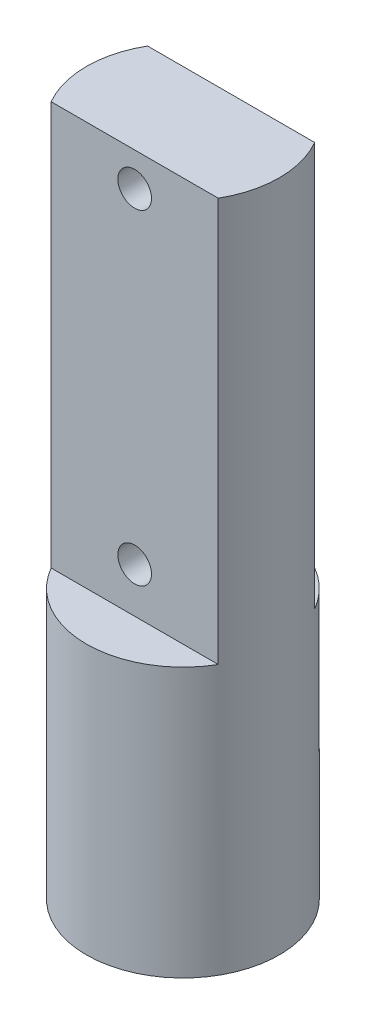
ISO-10303-21;
HEADER;
FILE_DESCRIPTION(('STEP AP214'),'2;1');
FILE_NAME('part.step','',(''),(''),'','','');
FILE_SCHEMA(('AUTOMOTIVE_DESIGN { 1 0 10303 214 1 1 1 1 }'));
ENDSEC;
DATA;
#1=APPLICATION_CONTEXT('core data for automotive mechanical design processes');
#2=APPLICATION_PROTOCOL_DEFINITION('international standard','automotive_design',2000,#1);
#3=PRODUCT_CONTEXT('',#1,'mechanical');
#4=PRODUCT('Part','Part','',(#3));
#5=PRODUCT_RELATED_PRODUCT_CATEGORY('part','',(#4));
#6=PRODUCT_DEFINITION_FORMATION('','',#4);
#7=PRODUCT_DEFINITION_CONTEXT('part definition',#1,'design');
#8=PRODUCT_DEFINITION('design','',#6,#7);
#9=PRODUCT_DEFINITION_SHAPE('','',#8);
#10=(LENGTH_UNIT() NAMED_UNIT(*) SI_UNIT(.MILLI.,.METRE.));
#11=(NAMED_UNIT(*) PLANE_ANGLE_UNIT() SI_UNIT($,.RADIAN.));
#12=(NAMED_UNIT(*) SI_UNIT($,.STERADIAN.) SOLID_ANGLE_UNIT());
#13=UNCERTAINTY_MEASURE_WITH_UNIT(LENGTH_MEASURE(1.E-05),#10,'distance_accuracy_value','');
#14=(GEOMETRIC_REPRESENTATION_CONTEXT(3) GLOBAL_UNCERTAINTY_ASSIGNED_CONTEXT((#13)) GLOBAL_UNIT_ASSIGNED_CONTEXT((#10,
#11,#12)) REPRESENTATION_CONTEXT('',''));
#15=CARTESIAN_POINT('',(0.,0.,0.));
#16=DIRECTION('',(0.,0.,1.));
#17=DIRECTION('',(1.,0.,0.));
#18=AXIS2_PLACEMENT_3D('',#15,#16,#17);
#19=CARTESIAN_POINT('',(0.,30.,0.));
#20=DIRECTION('',(0.,-1.,0.));
#21=DIRECTION('',(0.,0.,-1.));
#22=AXIS2_PLACEMENT_3D('',#19,#20,#21);
#23=CYLINDRICAL_SURFACE('',#22,4.3);
#24=CARTESIAN_POINT('',(-4.3,0.25,0.));
#25=CARTESIAN_POINT('',(-4.29999926638972,0.250001648928864,-0.0417880508407482));
#26=CARTESIAN_POINT('',(-4.2993845208085,0.253504282248725,-0.0835981818989071));
#27=CARTESIAN_POINT('',(-4.29699139488289,0.267415300580521,-0.166043809446362));
#28=CARTESIAN_POINT('',(-4.2952119760692,0.277829848648529,-0.206678223824261));
#29=CARTESIAN_POINT('',(-4.29068889751024,0.305239026463114,-0.285567841982349));
#30=CARTESIAN_POINT('',(-4.28794605633779,0.322228071424315,-0.323825033197758));
#31=CARTESIAN_POINT('',(-4.2817969720203,0.362288909924635,-0.396941522328641));
#32=CARTESIAN_POINT('',(-4.27839079673796,0.385360081314374,-0.431801167284692));
#33=CARTESIAN_POINT('',(-4.27125233222738,0.437186031595139,-0.497500986438229));
#34=CARTESIAN_POINT('',(-4.2675172948537,0.465991870364442,-0.528300588792169));
#35=CARTESIAN_POINT('',(-4.26016287101436,0.528359577761016,-0.584655380746544));
#36=CARTESIAN_POINT('',(-4.25654349221094,0.561921760693548,-0.610210223493173));
#37=CARTESIAN_POINT('',(-4.24980354586789,0.633131060922035,-0.655514911708166));
#38=CARTESIAN_POINT('',(-4.24668652699381,0.670804333579496,-0.67522422067108));
#39=CARTESIAN_POINT('',(-4.24134257686722,0.748990473640167,-0.708019045830521));
#40=CARTESIAN_POINT('',(-4.23911557958536,0.789503130131604,-0.721105053418914));
#41=CARTESIAN_POINT('',(-4.23583129642163,0.871786457694657,-0.740153116513572));
#42=CARTESIAN_POINT('',(-4.2347624743742,0.913540383710471,-0.746185479552076));
#43=CARTESIAN_POINT('',(-4.23388070551353,0.997480387393108,-0.751173093691664));
#44=CARTESIAN_POINT('',(-4.23406766135466,1.03966643130981,-0.750128893355033));
#45=CARTESIAN_POINT('',(-4.23566580216719,1.12276860803946,-0.74105019665266));
#46=CARTESIAN_POINT('',(-4.23706309423948,1.16369371315601,-0.733095025155751));
#47=CARTESIAN_POINT('',(-4.24090269461358,1.24361932870381,-0.710544848893874));
#48=CARTESIAN_POINT('',(-4.24334504185311,1.28261976736349,-0.695949596724768));
#49=CARTESIAN_POINT('',(-4.2490143958248,1.35782451258538,-0.660454167933393));
#50=CARTESIAN_POINT('',(-4.25224544405839,1.39401310944759,-0.639521379003615));
#51=CARTESIAN_POINT('',(-4.25912538619726,1.46239415898011,-0.591968203023326));
#52=CARTESIAN_POINT('',(-4.26277431694257,1.49458625880174,-0.565347314337231));
#53=CARTESIAN_POINT('',(-4.27013974606156,1.55451936881401,-0.506743025804354));
#54=CARTESIAN_POINT('',(-4.27385648859078,1.58219391382337,-0.474691640408195));
#55=CARTESIAN_POINT('',(-4.28089299866022,1.63178252295475,-0.4063652311659));
#56=CARTESIAN_POINT('',(-4.28421276317013,1.65369654310555,-0.370090175082709));
#57=CARTESIAN_POINT('',(-4.29008666470831,1.69114942661306,-0.294281196215158));
#58=CARTESIAN_POINT('',(-4.29264005113561,1.70668204539395,-0.254744126562682));
#59=CARTESIAN_POINT('',(-4.29668756322354,1.73086755941298,-0.173567831932192));
#60=CARTESIAN_POINT('',(-4.29818178604495,1.73952108570317,-0.131928800149992));
#61=CARTESIAN_POINT('',(-4.29992944696258,1.7496118073207,-0.0483030504041));
#62=CARTESIAN_POINT('',(-4.3001985614524,1.75114018168856,-0.00632765104635834));
#63=CARTESIAN_POINT('',(-4.29950875179802,1.74718083650912,0.0772792291684754));
#64=CARTESIAN_POINT('',(-4.29854987957069,1.74169341357592,0.11891072449026));
#65=CARTESIAN_POINT('',(-4.29552156034356,1.72393407350918,0.200363676970759));
#66=CARTESIAN_POINT('',(-4.29345956389819,1.71170765528832,0.240195355348366));
#67=CARTESIAN_POINT('',(-4.28845524658441,1.68086615385983,0.31724359746027));
#68=CARTESIAN_POINT('',(-4.28551287244903,1.66225068407471,0.354460002790035));
#69=CARTESIAN_POINT('',(-4.27903518267186,1.61895320290467,0.425614839024295));
#70=CARTESIAN_POINT('',(-4.27549444710934,1.59421468054526,0.459518380058128));
#71=CARTESIAN_POINT('',(-4.26822821844665,1.53945060738056,0.522725487316165));
#72=CARTESIAN_POINT('',(-4.26450271058035,1.50942463353665,0.552028685120829));
#73=CARTESIAN_POINT('',(-4.25723565824332,1.44452762498483,0.60554434083323));
#74=CARTESIAN_POINT('',(-4.25369669469759,1.40960526532975,0.62969496515801));
#75=CARTESIAN_POINT('',(-4.24725293297475,1.33614574580622,0.671787047550439));
#76=CARTESIAN_POINT('',(-4.24434811335954,1.29760870819983,0.689728715532231));
#77=CARTESIAN_POINT('',(-4.23952122215334,1.21818092720123,0.71880282079533));
#78=CARTESIAN_POINT('',(-4.23759484131931,1.17730140271792,0.729965158951758));
#79=CARTESIAN_POINT('',(-4.23493246488616,1.0942109356068,0.745257214187159));
#80=CARTESIAN_POINT('',(-4.23419635490076,1.05200012131488,0.749387607045549));
#81=CARTESIAN_POINT('',(-4.23400311265296,0.968063389187448,0.750478315138877));
#82=CARTESIAN_POINT('',(-4.23452860691097,0.926338745295987,0.747536027155071));
#83=CARTESIAN_POINT('',(-4.23676112646517,0.843988132513841,0.734776442246822));
#84=CARTESIAN_POINT('',(-4.23846814684283,0.803362159050271,0.724959173942));
#85=CARTESIAN_POINT('',(-4.24286451900407,0.724405073036289,0.698766999037293));
#86=CARTESIAN_POINT('',(-4.2455524973939,0.686070838833909,0.682401257576454));
#87=CARTESIAN_POINT('',(-4.2516091088947,0.612676452519474,0.643586916823754));
#88=CARTESIAN_POINT('',(-4.25497778098402,0.577616488069058,0.621137969166094));
#89=CARTESIAN_POINT('',(-4.26207088679326,0.511275265173909,0.570450068884655));
#90=CARTESIAN_POINT('',(-4.26579937145496,0.48004897367634,0.542139730404381));
#91=CARTESIAN_POINT('',(-4.27316041880179,0.42275719633857,0.480682687943183));
#92=CARTESIAN_POINT('',(-4.27679295920461,0.396692900355416,0.447534871958872));
#93=CARTESIAN_POINT('',(-4.28358514702488,0.350281411357932,0.377041827580638));
#94=CARTESIAN_POINT('',(-4.28674096989397,0.329979413928963,0.339666468462769));
#95=CARTESIAN_POINT('',(-4.29218692806471,0.295974054354022,0.261994677005647));
#96=CARTESIAN_POINT('',(-4.29447790760072,0.282264253503343,0.221701139351332));
#97=CARTESIAN_POINT('',(-4.29744780863532,0.264739781276116,0.151053464857476));
#98=CARTESIAN_POINT('',(-4.29839966207502,0.259221425489235,0.121121834423538));
#99=CARTESIAN_POINT('',(-4.29967601838447,0.25185097154175,0.0607973595026825));
#100=CARTESIAN_POINT('',(-4.30000053376673,0.249998800257571,0.0304045242268715));
#101=CARTESIAN_POINT('',(-4.3,0.25,0.));
#102=B_SPLINE_CURVE_WITH_KNOTS('',3,(#24,#25,#26,#27,#28,#29,#30,#31,#32,#33,#34,#35,#36,#37,
#38,#39,#40,#41,#42,#43,#44,#45,#46,#47,#48,#49,#50,#51,#52,#53,#54,#55,#56,#57,#58,#59,#60,#61,
#62,#63,#64,#65,#66,#67,#68,#69,#70,#71,#72,#73,#74,#75,#76,#77,#78,#79,#80,#81,#82,#83,#84,#85,
#86,#87,#88,#89,#90,#91,#92,#93,#94,#95,#96,#97,#98,#99,#100,#101),.UNSPECIFIED.,.T.,.F.,(4,2,2,
2,2,2,2,2,2,2,2,2,2,2,2,2,2,2,2,2,2,2,2,2,2,2,2,2,2,2,2,2,2,2,2,2,2,2,4),(0.,0.125252996199785,
0.250617825406938,0.375876394889566,0.50112215646291,0.627537418061207,0.753961037239065,
0.881241888884177,1.00851329600257,1.13450500342474,1.26048694431127,1.38504167555774,
1.5096010479948,1.63481261051328,1.76003522004597,1.88696029547256,2.01388633971493,
2.14093629439122,2.26797459282222,2.39338266364192,2.51878543263069,2.64335172479294,
2.76792555532226,2.89369502791514,3.01947456765252,3.14668779548681,3.27389672204023,
3.40054042803455,3.52717196271096,3.65206968700409,3.77696689136787,3.90168989961903,
4.02642005186868,4.15276953204653,4.27914810238747,4.40649211316999,4.53371149107416,
4.62484600537639,4.71597870194454),.UNSPECIFIED.);
#103=CARTESIAN_POINT('',(-4.3,0.25,0.));
#104=VERTEX_POINT('',#103);
#105=EDGE_CURVE('E11',#104,#104,#102,.T.);
#106=ORIENTED_EDGE('',*,*,#105,.T.);
#107=EDGE_LOOP('',(#106));
#108=FACE_BOUND('',#107,.T.);
#109=CARTESIAN_POINT('',(0.,30.,0.));
#110=DIRECTION('',(0.,1.,0.));
#111=DIRECTION('',(0.,0.,1.));
#112=AXIS2_PLACEMENT_3D('',#109,#110,#111);
#113=CIRCLE('',#112,4.3);
#114=CARTESIAN_POINT('',(3.72390923627309,30.,2.15));
#115=VERTEX_POINT('',#114);
#116=CARTESIAN_POINT('',(3.72390923627308,30.,-2.15));
#117=VERTEX_POINT('',#116);
#118=EDGE_CURVE('E112',#115,#117,#113,.T.);
#119=ORIENTED_EDGE('',*,*,#118,.F.);
#120=DIRECTION('',(0.,1.,0.));
#121=VECTOR('',#120,1.);
#122=CARTESIAN_POINT('',(3.72390923627308,12.,2.15));
#123=LINE('',#122,#121);
#124=CARTESIAN_POINT('',(3.72390923627308,12.,2.15));
#125=VERTEX_POINT('',#124);
#126=EDGE_CURVE('E51',#125,#115,#123,.T.);
#127=ORIENTED_EDGE('',*,*,#126,.F.);
#128=CARTESIAN_POINT('',(0.,12.,0.));
#129=DIRECTION('',(0.,1.,0.));
#130=DIRECTION('',(0.,0.,1.));
#131=AXIS2_PLACEMENT_3D('',#128,#129,#130);
#132=CIRCLE('',#131,4.3);
#133=CARTESIAN_POINT('',(-3.72390923627308,12.,2.15));
#134=VERTEX_POINT('',#133);
#135=EDGE_CURVE('E81',#134,#125,#132,.T.);
#136=ORIENTED_EDGE('',*,*,#135,.F.);
#137=DIRECTION('',(0.,1.,0.));
#138=VECTOR('',#137,1.);
#139=CARTESIAN_POINT('',(-3.72390923627308,12.,2.15));
#140=LINE('',#139,#138);
#141=CARTESIAN_POINT('',(-3.72390923627308,30.,2.15));
#142=VERTEX_POINT('',#141);
#143=EDGE_CURVE('E85',#134,#142,#140,.T.);
#144=ORIENTED_EDGE('',*,*,#143,.T.);
#145=CARTESIAN_POINT('',(-3.72390923627309,30.,-2.15));
#146=VERTEX_POINT('',#145);
#147=EDGE_CURVE('E44',#146,#142,#113,.T.);
#148=ORIENTED_EDGE('',*,*,#147,.F.);
#149=DIRECTION('',(0.,1.,0.));
#150=VECTOR('',#149,1.);
#151=CARTESIAN_POINT('',(-3.72390923627308,12.,-2.15));
#152=LINE('',#151,#150);
#153=CARTESIAN_POINT('',(-3.72390923627308,12.,-2.15));
#154=VERTEX_POINT('',#153);
#155=EDGE_CURVE('E59',#154,#146,#152,.T.);
#156=ORIENTED_EDGE('',*,*,#155,.F.);
#157=CARTESIAN_POINT('',(0.,12.,0.));
#158=DIRECTION('',(0.,1.,0.));
#159=DIRECTION('',(0.,0.,-1.));
#160=AXIS2_PLACEMENT_3D('',#157,#158,#159);
#161=CIRCLE('',#160,4.3);
#162=CARTESIAN_POINT('',(3.72390923627308,12.,-2.15));
#163=VERTEX_POINT('',#162);
#164=EDGE_CURVE('E103',#163,#154,#161,.T.);
#165=ORIENTED_EDGE('',*,*,#164,.F.);
#166=DIRECTION('',(0.,1.,0.));
#167=VECTOR('',#166,1.);
#168=CARTESIAN_POINT('',(3.72390923627308,12.,-2.15));
#169=LINE('',#168,#167);
#170=EDGE_CURVE('E106',#163,#117,#169,.T.);
#171=ORIENTED_EDGE('',*,*,#170,.T.);
#172=EDGE_LOOP('',(#119,#127,#136,#144,#148,#156,#165,#171));
#173=FACE_BOUND('',#172,.T.);
#174=CARTESIAN_POINT('',(0.,0.,0.));
#175=DIRECTION('',(0.,1.,0.));
#176=DIRECTION('',(0.,0.,1.));
#177=AXIS2_PLACEMENT_3D('',#174,#175,#176);
#178=CIRCLE('',#177,4.3);
#179=CARTESIAN_POINT('',(0.,0.,4.3));
#180=VERTEX_POINT('',#179);
#181=EDGE_CURVE('E109',#180,#180,#178,.T.);
#182=ORIENTED_EDGE('',*,*,#181,.T.);
#183=EDGE_LOOP('',(#182));
#184=FACE_BOUND('',#183,.T.);
#185=ADVANCED_FACE('F33',(#108,#173,#184),#23,.T.);
#186=CARTESIAN_POINT('',(0.,30.,0.));
#187=DIRECTION('',(0.,1.,0.));
#188=DIRECTION('',(0.,0.,1.));
#189=AXIS2_PLACEMENT_3D('',#186,#187,#188);
#190=PLANE('',#189);
#191=DIRECTION('',(-1.,0.,0.));
#192=VECTOR('',#191,1.);
#193=CARTESIAN_POINT('',(0.,30.,2.15));
#194=LINE('',#193,#192);
#195=EDGE_CURVE('E82',#115,#142,#194,.T.);
#196=ORIENTED_EDGE('',*,*,#195,.F.);
#197=ORIENTED_EDGE('',*,*,#118,.T.);
#198=DIRECTION('',(1.,0.,0.));
#199=VECTOR('',#198,1.);
#200=CARTESIAN_POINT('',(0.,30.,-2.15));
#201=LINE('',#200,#199);
#202=EDGE_CURVE('E98',#146,#117,#201,.T.);
#203=ORIENTED_EDGE('',*,*,#202,.F.);
#204=ORIENTED_EDGE('',*,*,#147,.T.);
#205=EDGE_LOOP('',(#196,#197,#203,#204));
#206=FACE_BOUND('',#205,.T.);
#207=ADVANCED_FACE('F116',(#206),#190,.T.);
#208=CARTESIAN_POINT('',(0.,0.,0.));
#209=DIRECTION('',(0.,1.,0.));
#210=DIRECTION('',(0.,0.,1.));
#211=AXIS2_PLACEMENT_3D('',#208,#209,#210);
#212=PLANE('',#211);
#213=ORIENTED_EDGE('',*,*,#181,.F.);
#214=EDGE_LOOP('',(#213));
#215=FACE_BOUND('',#214,.T.);
#216=ADVANCED_FACE('F129',(#215),#212,.F.);
#217=CARTESIAN_POINT('',(0.,12.,-2.15));
#218=DIRECTION('',(0.,0.,1.));
#219=DIRECTION('',(1.,0.,0.));
#220=AXIS2_PLACEMENT_3D('',#217,#218,#219);
#221=PLANE('',#220);
#222=CARTESIAN_POINT('',(0.,28.5,-2.15));
#223=DIRECTION('',(0.,0.,1.));
#224=DIRECTION('',(1.,0.,0.));
#225=AXIS2_PLACEMENT_3D('',#222,#223,#224);
#226=CIRCLE('',#225,0.750000000000001);
#227=CARTESIAN_POINT('',(0.750000000000001,28.5,-2.15));
#228=VERTEX_POINT('',#227);
#229=EDGE_CURVE('E214',#228,#228,#226,.T.);
#230=ORIENTED_EDGE('',*,*,#229,.T.);
#231=EDGE_LOOP('',(#230));
#232=FACE_BOUND('',#231,.T.);
#233=CARTESIAN_POINT('',(0.,14.,-2.15));
#234=DIRECTION('',(0.,0.,1.));
#235=DIRECTION('',(1.,0.,0.));
#236=AXIS2_PLACEMENT_3D('',#233,#234,#235);
#237=CIRCLE('',#236,0.750000000000001);
#238=CARTESIAN_POINT('',(0.750000000000001,14.,-2.15));
#239=VERTEX_POINT('',#238);
#240=EDGE_CURVE('E97',#239,#239,#237,.T.);
#241=ORIENTED_EDGE('',*,*,#240,.T.);
#242=EDGE_LOOP('',(#241));
#243=FACE_BOUND('',#242,.T.);
#244=ORIENTED_EDGE('',*,*,#202,.T.);
#245=ORIENTED_EDGE('',*,*,#170,.F.);
#246=DIRECTION('',(1.,0.,0.));
#247=VECTOR('',#246,1.);
#248=CARTESIAN_POINT('',(0.,12.,-2.15));
#249=LINE('',#248,#247);
#250=EDGE_CURVE('E100',#154,#163,#249,.T.);
#251=ORIENTED_EDGE('',*,*,#250,.F.);
#252=ORIENTED_EDGE('',*,*,#155,.T.);
#253=EDGE_LOOP('',(#244,#245,#251,#252));
#254=FACE_BOUND('',#253,.T.);
#255=ADVANCED_FACE('F117',(#232,#243,#254),#221,.F.);
#256=CARTESIAN_POINT('',(0.,12.,0.));
#257=DIRECTION('',(0.,-1.,0.));
#258=DIRECTION('',(0.,0.,-1.));
#259=AXIS2_PLACEMENT_3D('',#256,#257,#258);
#260=PLANE('',#259);
#261=ORIENTED_EDGE('',*,*,#250,.T.);
#262=ORIENTED_EDGE('',*,*,#164,.T.);
#263=EDGE_LOOP('',(#261,#262));
#264=FACE_BOUND('',#263,.T.);
#265=ADVANCED_FACE('F120',(#264),#260,.F.);
#266=CARTESIAN_POINT('',(0.,12.,2.15));
#267=DIRECTION('',(0.,0.,-1.));
#268=DIRECTION('',(-1.,0.,0.));
#269=AXIS2_PLACEMENT_3D('',#266,#267,#268);
#270=PLANE('',#269);
#271=CARTESIAN_POINT('',(0.,28.5,2.15));
#272=DIRECTION('',(0.,0.,1.));
#273=DIRECTION('',(1.,0.,0.));
#274=AXIS2_PLACEMENT_3D('',#271,#272,#273);
#275=CIRCLE('',#274,0.750000000000001);
#276=CARTESIAN_POINT('',(0.750000000000001,28.5,2.15));
#277=VERTEX_POINT('',#276);
#278=EDGE_CURVE('E211',#277,#277,#275,.T.);
#279=ORIENTED_EDGE('',*,*,#278,.F.);
#280=EDGE_LOOP('',(#279));
#281=FACE_BOUND('',#280,.T.);
#282=CARTESIAN_POINT('',(0.,14.,2.15));
#283=DIRECTION('',(0.,0.,1.));
#284=DIRECTION('',(1.,0.,0.));
#285=AXIS2_PLACEMENT_3D('',#282,#283,#284);
#286=CIRCLE('',#285,0.750000000000001);
#287=CARTESIAN_POINT('',(0.750000000000001,14.,2.15));
#288=VERTEX_POINT('',#287);
#289=EDGE_CURVE('E217',#288,#288,#286,.T.);
#290=ORIENTED_EDGE('',*,*,#289,.F.);
#291=EDGE_LOOP('',(#290));
#292=FACE_BOUND('',#291,.T.);
#293=ORIENTED_EDGE('',*,*,#195,.T.);
#294=ORIENTED_EDGE('',*,*,#143,.F.);
#295=DIRECTION('',(-1.,0.,0.));
#296=VECTOR('',#295,1.);
#297=CARTESIAN_POINT('',(0.,12.,2.15));
#298=LINE('',#297,#296);
#299=EDGE_CURVE('E77',#125,#134,#298,.T.);
#300=ORIENTED_EDGE('',*,*,#299,.F.);
#301=ORIENTED_EDGE('',*,*,#126,.T.);
#302=EDGE_LOOP('',(#293,#294,#300,#301));
#303=FACE_BOUND('',#302,.T.);
#304=ADVANCED_FACE('F86',(#281,#292,#303),#270,.F.);
#305=CARTESIAN_POINT('',(0.,12.,0.));
#306=DIRECTION('',(0.,1.,0.));
#307=DIRECTION('',(0.,0.,1.));
#308=AXIS2_PLACEMENT_3D('',#305,#306,#307);
#309=PLANE('',#308);
#310=ORIENTED_EDGE('',*,*,#299,.T.);
#311=ORIENTED_EDGE('',*,*,#135,.T.);
#312=EDGE_LOOP('',(#310,#311));
#313=FACE_BOUND('',#312,.T.);
#314=ADVANCED_FACE('F79',(#313),#309,.T.);
#315=CARTESIAN_POINT('',(0.,14.,-7.85));
#316=DIRECTION('',(0.,0.,1.));
#317=DIRECTION('',(1.,0.,0.));
#318=AXIS2_PLACEMENT_3D('',#315,#316,#317);
#319=CYLINDRICAL_SURFACE('',#318,0.750000000000001);
#320=ORIENTED_EDGE('',*,*,#289,.T.);
#321=EDGE_LOOP('',(#320));
#322=FACE_BOUND('',#321,.T.);
#323=ORIENTED_EDGE('',*,*,#240,.F.);
#324=EDGE_LOOP('',(#323));
#325=FACE_BOUND('',#324,.T.);
#326=ADVANCED_FACE('F143',(#322,#325),#319,.F.);
#327=CARTESIAN_POINT('',(-4.3,1.,0.));
#328=DIRECTION('',(1.,0.,0.));
#329=DIRECTION('',(0.,0.,-1.));
#330=AXIS2_PLACEMENT_3D('',#327,#328,#329);
#331=CYLINDRICAL_SURFACE('',#330,0.75);
#332=CARTESIAN_POINT('',(0.,1.,0.));
#333=DIRECTION('',(1.,0.,0.));
#334=DIRECTION('',(0.,0.,-1.));
#335=AXIS2_PLACEMENT_3D('',#332,#333,#334);
#336=CIRCLE('',#335,0.75);
#337=CARTESIAN_POINT('',(0.,1.,-0.75));
#338=VERTEX_POINT('',#337);
#339=EDGE_CURVE('E215',#338,#338,#336,.T.);
#340=ORIENTED_EDGE('',*,*,#339,.T.);
#341=EDGE_LOOP('',(#340));
#342=FACE_BOUND('',#341,.T.);
#343=ORIENTED_EDGE('',*,*,#105,.F.);
#344=EDGE_LOOP('',(#343));
#345=FACE_BOUND('',#344,.T.);
#346=ADVANCED_FACE('F140',(#342,#345),#331,.F.);
#347=CARTESIAN_POINT('',(0.,1.,0.));
#348=DIRECTION('',(1.,0.,0.));
#349=DIRECTION('',(0.,0.,-1.));
#350=AXIS2_PLACEMENT_3D('',#347,#348,#349);
#351=PLANE('',#350);
#352=ORIENTED_EDGE('',*,*,#339,.F.);
#353=EDGE_LOOP('',(#352));
#354=FACE_BOUND('',#353,.T.);
#355=ADVANCED_FACE('F142',(#354),#351,.F.);
#356=CARTESIAN_POINT('',(0.,28.5,-7.85));
#357=DIRECTION('',(0.,0.,1.));
#358=DIRECTION('',(1.,0.,0.));
#359=AXIS2_PLACEMENT_3D('',#356,#357,#358);
#360=CYLINDRICAL_SURFACE('',#359,0.750000000000001);
#361=ORIENTED_EDGE('',*,*,#278,.T.);
#362=EDGE_LOOP('',(#361));
#363=FACE_BOUND('',#362,.T.);
#364=ORIENTED_EDGE('',*,*,#229,.F.);
#365=EDGE_LOOP('',(#364));
#366=FACE_BOUND('',#365,.T.);
#367=ADVANCED_FACE('F149',(#363,#366),#360,.F.);
#368=CLOSED_SHELL('',(#185,#207,#216,#255,#265,#304,#314,#326,#346,#355,#367));
#369=MANIFOLD_SOLID_BREP('B2',#368);
#370=ADVANCED_BREP_SHAPE_REPRESENTATION('',(#18,#369),#14);
#371=SHAPE_DEFINITION_REPRESENTATION(#9,#370);
ENDSEC;
END-ISO-10303-21;
